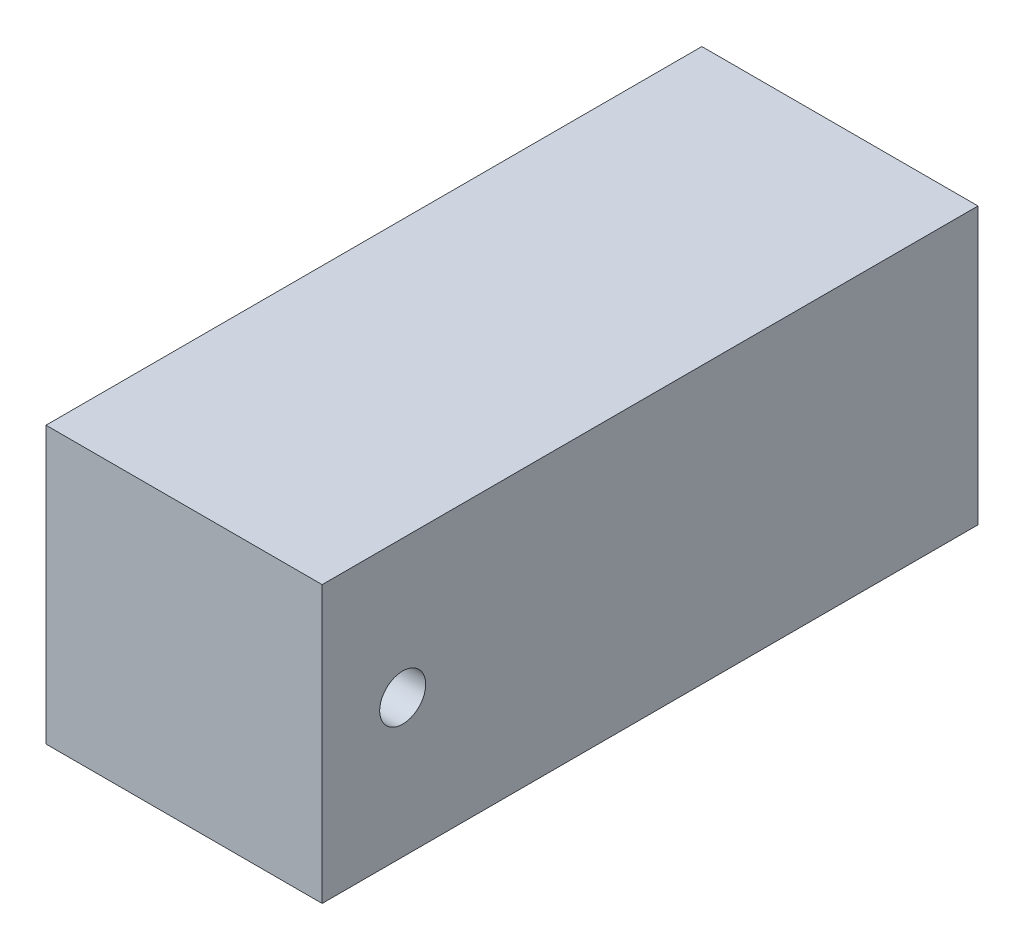
ISO-10303-21;
HEADER;
FILE_DESCRIPTION(('STEP AP214'),'2;1');
FILE_NAME('part.step','',(''),(''),'','','');
FILE_SCHEMA(('AUTOMOTIVE_DESIGN { 1 0 10303 214 1 1 1 1 }'));
ENDSEC;
DATA;
#1=APPLICATION_CONTEXT('core data for automotive mechanical design processes');
#2=APPLICATION_PROTOCOL_DEFINITION('international standard','automotive_design',2000,#1);
#3=PRODUCT_CONTEXT('',#1,'mechanical');
#4=PRODUCT('Part','Part','',(#3));
#5=PRODUCT_RELATED_PRODUCT_CATEGORY('part','',(#4));
#6=PRODUCT_DEFINITION_FORMATION('','',#4);
#7=PRODUCT_DEFINITION_CONTEXT('part definition',#1,'design');
#8=PRODUCT_DEFINITION('design','',#6,#7);
#9=PRODUCT_DEFINITION_SHAPE('','',#8);
#10=(LENGTH_UNIT() NAMED_UNIT(*) SI_UNIT(.MILLI.,.METRE.));
#11=(NAMED_UNIT(*) PLANE_ANGLE_UNIT() SI_UNIT($,.RADIAN.));
#12=(NAMED_UNIT(*) SI_UNIT($,.STERADIAN.) SOLID_ANGLE_UNIT());
#13=UNCERTAINTY_MEASURE_WITH_UNIT(LENGTH_MEASURE(1.E-05),#10,'distance_accuracy_value','');
#14=(GEOMETRIC_REPRESENTATION_CONTEXT(3) GLOBAL_UNCERTAINTY_ASSIGNED_CONTEXT((#13)) GLOBAL_UNIT_ASSIGNED_CONTEXT((#10,
#11,#12)) REPRESENTATION_CONTEXT('',''));
#15=CARTESIAN_POINT('',(0.,0.,0.));
#16=DIRECTION('',(0.,0.,1.));
#17=DIRECTION('',(1.,0.,0.));
#18=AXIS2_PLACEMENT_3D('',#15,#16,#17);
#19=CARTESIAN_POINT('',(38.1,76.2,90.4875));
#20=DIRECTION('',(-1.,0.,0.));
#21=DIRECTION('',(0.,0.,1.));
#22=AXIS2_PLACEMENT_3D('',#19,#20,#21);
#23=PLANE('',#22);
#24=CARTESIAN_POINT('',(38.1,38.1,68.2625));
#25=DIRECTION('',(1.,0.,0.));
#26=DIRECTION('',(0.,0.,-1.));
#27=AXIS2_PLACEMENT_3D('',#24,#25,#26);
#28=CIRCLE('',#27,6.35);
#29=CARTESIAN_POINT('',(38.1,38.1,61.9125));
#30=VERTEX_POINT('',#29);
#31=EDGE_CURVE('E116',#30,#30,#28,.T.);
#32=ORIENTED_EDGE('',*,*,#31,.F.);
#33=EDGE_LOOP('',(#32));
#34=FACE_BOUND('',#33,.T.);
#35=DIRECTION('',(0.,0.,-1.));
#36=VECTOR('',#35,1.);
#37=CARTESIAN_POINT('',(38.1,0.,90.4875));
#38=LINE('',#37,#36);
#39=CARTESIAN_POINT('',(38.1,0.,90.4875));
#40=VERTEX_POINT('',#39);
#41=CARTESIAN_POINT('',(38.1,0.,-90.4875));
#42=VERTEX_POINT('',#41);
#43=EDGE_CURVE('E100',#40,#42,#38,.T.);
#44=ORIENTED_EDGE('',*,*,#43,.T.);
#45=DIRECTION('',(0.,-1.,0.));
#46=VECTOR('',#45,1.);
#47=CARTESIAN_POINT('',(38.1,76.2,-90.4875));
#48=LINE('',#47,#46);
#49=CARTESIAN_POINT('',(38.1,76.2,-90.4875));
#50=VERTEX_POINT('',#49);
#51=EDGE_CURVE('E11',#50,#42,#48,.T.);
#52=ORIENTED_EDGE('',*,*,#51,.F.);
#53=DIRECTION('',(0.,0.,-1.));
#54=VECTOR('',#53,1.);
#55=CARTESIAN_POINT('',(38.1,76.2,90.4875));
#56=LINE('',#55,#54);
#57=CARTESIAN_POINT('',(38.1,76.2,90.4875));
#58=VERTEX_POINT('',#57);
#59=EDGE_CURVE('E88',#58,#50,#56,.T.);
#60=ORIENTED_EDGE('',*,*,#59,.F.);
#61=DIRECTION('',(0.,-1.,0.));
#62=VECTOR('',#61,1.);
#63=CARTESIAN_POINT('',(38.1,76.2,90.4875));
#64=LINE('',#63,#62);
#65=EDGE_CURVE('E96',#58,#40,#64,.T.);
#66=ORIENTED_EDGE('',*,*,#65,.T.);
#67=EDGE_LOOP('',(#44,#52,#60,#66));
#68=FACE_BOUND('',#67,.T.);
#69=ADVANCED_FACE('F37',(#34,#68),#23,.F.);
#70=CARTESIAN_POINT('',(-38.1,76.2,-90.4875));
#71=DIRECTION('',(0.,0.,1.));
#72=DIRECTION('',(1.,0.,0.));
#73=AXIS2_PLACEMENT_3D('',#70,#71,#72);
#74=PLANE('',#73);
#75=DIRECTION('',(-1.,0.,0.));
#76=VECTOR('',#75,1.);
#77=CARTESIAN_POINT('',(-38.1,0.,-90.4875));
#78=LINE('',#77,#76);
#79=CARTESIAN_POINT('',(-38.1,0.,-90.4875));
#80=VERTEX_POINT('',#79);
#81=EDGE_CURVE('E92',#42,#80,#78,.T.);
#82=ORIENTED_EDGE('',*,*,#81,.T.);
#83=DIRECTION('',(0.,-1.,0.));
#84=VECTOR('',#83,1.);
#85=CARTESIAN_POINT('',(-38.1,76.2,-90.4875));
#86=LINE('',#85,#84);
#87=CARTESIAN_POINT('',(-38.1,76.2,-90.4875));
#88=VERTEX_POINT('',#87);
#89=EDGE_CURVE('E45',#88,#80,#86,.T.);
#90=ORIENTED_EDGE('',*,*,#89,.F.);
#91=DIRECTION('',(-1.,0.,0.));
#92=VECTOR('',#91,1.);
#93=CARTESIAN_POINT('',(-38.1,76.2,-90.4875));
#94=LINE('',#93,#92);
#95=EDGE_CURVE('E83',#50,#88,#94,.T.);
#96=ORIENTED_EDGE('',*,*,#95,.F.);
#97=ORIENTED_EDGE('',*,*,#51,.T.);
#98=EDGE_LOOP('',(#82,#90,#96,#97));
#99=FACE_BOUND('',#98,.T.);
#100=ADVANCED_FACE('F91',(#99),#74,.F.);
#101=CARTESIAN_POINT('',(-38.1,76.2,90.4875));
#102=DIRECTION('',(1.,0.,0.));
#103=DIRECTION('',(0.,0.,-1.));
#104=AXIS2_PLACEMENT_3D('',#101,#102,#103);
#105=PLANE('',#104);
#106=CARTESIAN_POINT('',(-38.1,38.1,68.2625));
#107=DIRECTION('',(1.,0.,0.));
#108=DIRECTION('',(0.,0.,-1.));
#109=AXIS2_PLACEMENT_3D('',#106,#107,#108);
#110=CIRCLE('',#109,6.35);
#111=CARTESIAN_POINT('',(-38.1,38.1,61.9125));
#112=VERTEX_POINT('',#111);
#113=EDGE_CURVE('E104',#112,#112,#110,.T.);
#114=ORIENTED_EDGE('',*,*,#113,.T.);
#115=EDGE_LOOP('',(#114));
#116=FACE_BOUND('',#115,.T.);
#117=DIRECTION('',(0.,0.,1.));
#118=VECTOR('',#117,1.);
#119=CARTESIAN_POINT('',(-38.1,0.,90.4875));
#120=LINE('',#119,#118);
#121=CARTESIAN_POINT('',(-38.1,0.,90.4875));
#122=VERTEX_POINT('',#121);
#123=EDGE_CURVE('E70',#80,#122,#120,.T.);
#124=ORIENTED_EDGE('',*,*,#123,.T.);
#125=DIRECTION('',(0.,-1.,0.));
#126=VECTOR('',#125,1.);
#127=CARTESIAN_POINT('',(-38.1,76.2,90.4875));
#128=LINE('',#127,#126);
#129=CARTESIAN_POINT('',(-38.1,76.2,90.4875));
#130=VERTEX_POINT('',#129);
#131=EDGE_CURVE('E93',#130,#122,#128,.T.);
#132=ORIENTED_EDGE('',*,*,#131,.F.);
#133=DIRECTION('',(0.,0.,1.));
#134=VECTOR('',#133,1.);
#135=CARTESIAN_POINT('',(-38.1,76.2,90.4875));
#136=LINE('',#135,#134);
#137=EDGE_CURVE('E86',#88,#130,#136,.T.);
#138=ORIENTED_EDGE('',*,*,#137,.F.);
#139=ORIENTED_EDGE('',*,*,#89,.T.);
#140=EDGE_LOOP('',(#124,#132,#138,#139));
#141=FACE_BOUND('',#140,.T.);
#142=ADVANCED_FACE('F94',(#116,#141),#105,.F.);
#143=CARTESIAN_POINT('',(-38.1,76.2,90.4875));
#144=DIRECTION('',(0.,0.,-1.));
#145=DIRECTION('',(-1.,0.,0.));
#146=AXIS2_PLACEMENT_3D('',#143,#144,#145);
#147=PLANE('',#146);
#148=DIRECTION('',(1.,0.,0.));
#149=VECTOR('',#148,1.);
#150=CARTESIAN_POINT('',(-38.1,0.,90.4875));
#151=LINE('',#150,#149);
#152=EDGE_CURVE('E76',#122,#40,#151,.T.);
#153=ORIENTED_EDGE('',*,*,#152,.T.);
#154=ORIENTED_EDGE('',*,*,#65,.F.);
#155=DIRECTION('',(1.,0.,0.));
#156=VECTOR('',#155,1.);
#157=CARTESIAN_POINT('',(-38.1,76.2,90.4875));
#158=LINE('',#157,#156);
#159=EDGE_CURVE('E53',#130,#58,#158,.T.);
#160=ORIENTED_EDGE('',*,*,#159,.F.);
#161=ORIENTED_EDGE('',*,*,#131,.T.);
#162=EDGE_LOOP('',(#153,#154,#160,#161));
#163=FACE_BOUND('',#162,.T.);
#164=ADVANCED_FACE('F110',(#163),#147,.F.);
#165=CARTESIAN_POINT('',(0.,76.2,0.));
#166=DIRECTION('',(0.,-1.,0.));
#167=DIRECTION('',(0.,0.,-1.));
#168=AXIS2_PLACEMENT_3D('',#165,#166,#167);
#169=PLANE('',#168);
#170=ORIENTED_EDGE('',*,*,#59,.T.);
#171=ORIENTED_EDGE('',*,*,#95,.T.);
#172=ORIENTED_EDGE('',*,*,#137,.T.);
#173=ORIENTED_EDGE('',*,*,#159,.T.);
#174=EDGE_LOOP('',(#170,#171,#172,#173));
#175=FACE_BOUND('',#174,.T.);
#176=ADVANCED_FACE('F84',(#175),#169,.F.);
#177=CARTESIAN_POINT('',(0.,0.,0.));
#178=DIRECTION('',(0.,-1.,0.));
#179=DIRECTION('',(0.,0.,-1.));
#180=AXIS2_PLACEMENT_3D('',#177,#178,#179);
#181=PLANE('',#180);
#182=ORIENTED_EDGE('',*,*,#43,.F.);
#183=ORIENTED_EDGE('',*,*,#152,.F.);
#184=ORIENTED_EDGE('',*,*,#123,.F.);
#185=ORIENTED_EDGE('',*,*,#81,.F.);
#186=EDGE_LOOP('',(#182,#183,#184,#185));
#187=FACE_BOUND('',#186,.T.);
#188=ADVANCED_FACE('F113',(#187),#181,.T.);
#189=CARTESIAN_POINT('',(-38.1,38.1,68.2625));
#190=DIRECTION('',(1.,0.,0.));
#191=DIRECTION('',(0.,0.,-1.));
#192=AXIS2_PLACEMENT_3D('',#189,#190,#191);
#193=CYLINDRICAL_SURFACE('',#192,6.35);
#194=ORIENTED_EDGE('',*,*,#113,.F.);
#195=EDGE_LOOP('',(#194));
#196=FACE_BOUND('',#195,.T.);
#197=ORIENTED_EDGE('',*,*,#31,.T.);
#198=EDGE_LOOP('',(#197));
#199=FACE_BOUND('',#198,.T.);
#200=ADVANCED_FACE('F123',(#196,#199),#193,.F.);
#201=CLOSED_SHELL('',(#69,#100,#142,#164,#176,#188,#200));
#202=MANIFOLD_SOLID_BREP('B2',#201);
#203=ADVANCED_BREP_SHAPE_REPRESENTATION('',(#18,#202),#14);
#204=SHAPE_DEFINITION_REPRESENTATION(#9,#203);
ENDSEC;
END-ISO-10303-21;
